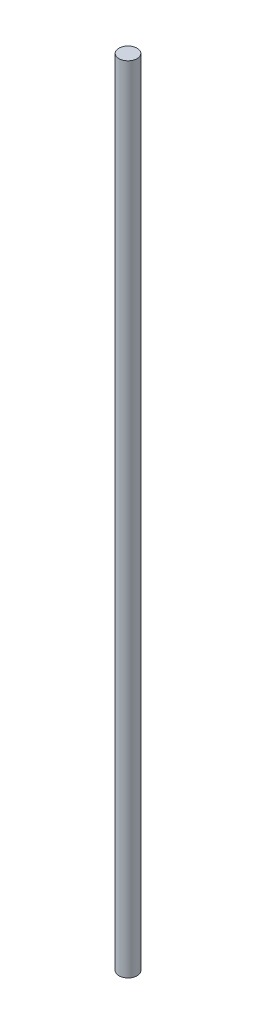
ISO-10303-21;
HEADER;
FILE_DESCRIPTION(('STEP AP214'),'2;1');
FILE_NAME('part.step','',(''),(''),'','','');
FILE_SCHEMA(('AUTOMOTIVE_DESIGN { 1 0 10303 214 1 1 1 1 }'));
ENDSEC;
DATA;
#1=APPLICATION_CONTEXT('core data for automotive mechanical design processes');
#2=APPLICATION_PROTOCOL_DEFINITION('international standard','automotive_design',2000,#1);
#3=PRODUCT_CONTEXT('',#1,'mechanical');
#4=PRODUCT('Part','Part','',(#3));
#5=PRODUCT_RELATED_PRODUCT_CATEGORY('part','',(#4));
#6=PRODUCT_DEFINITION_FORMATION('','',#4);
#7=PRODUCT_DEFINITION_CONTEXT('part definition',#1,'design');
#8=PRODUCT_DEFINITION('design','',#6,#7);
#9=PRODUCT_DEFINITION_SHAPE('','',#8);
#10=(LENGTH_UNIT() NAMED_UNIT(*) SI_UNIT(.MILLI.,.METRE.));
#11=(NAMED_UNIT(*) PLANE_ANGLE_UNIT() SI_UNIT($,.RADIAN.));
#12=(NAMED_UNIT(*) SI_UNIT($,.STERADIAN.) SOLID_ANGLE_UNIT());
#13=UNCERTAINTY_MEASURE_WITH_UNIT(LENGTH_MEASURE(1.E-05),#10,'distance_accuracy_value','');
#14=(GEOMETRIC_REPRESENTATION_CONTEXT(3) GLOBAL_UNCERTAINTY_ASSIGNED_CONTEXT((#13)) GLOBAL_UNIT_ASSIGNED_CONTEXT((#10,
#11,#12)) REPRESENTATION_CONTEXT('',''));
#15=CARTESIAN_POINT('',(0.,0.,0.));
#16=DIRECTION('',(0.,0.,1.));
#17=DIRECTION('',(1.,0.,0.));
#18=AXIS2_PLACEMENT_3D('',#15,#16,#17);
#19=CARTESIAN_POINT('',(0.,350.,0.));
#20=DIRECTION('',(0.,-1.,0.));
#21=DIRECTION('',(0.,0.,-1.));
#22=AXIS2_PLACEMENT_3D('',#19,#20,#21);
#23=CYLINDRICAL_SURFACE('',#22,4.);
#24=CARTESIAN_POINT('',(0.,350.,0.));
#25=DIRECTION('',(0.,-1.,0.));
#26=DIRECTION('',(0.,0.,-1.));
#27=AXIS2_PLACEMENT_3D('',#24,#25,#26);
#28=CIRCLE('',#27,4.);
#29=CARTESIAN_POINT('',(0.,350.,-4.));
#30=VERTEX_POINT('',#29);
#31=EDGE_CURVE('E10',#30,#30,#28,.T.);
#32=ORIENTED_EDGE('',*,*,#31,.T.);
#33=EDGE_LOOP('',(#32));
#34=FACE_BOUND('',#33,.T.);
#35=CARTESIAN_POINT('',(0.,0.,0.));
#36=DIRECTION('',(0.,-1.,0.));
#37=DIRECTION('',(0.,0.,-1.));
#38=AXIS2_PLACEMENT_3D('',#35,#36,#37);
#39=CIRCLE('',#38,4.);
#40=CARTESIAN_POINT('',(0.,0.,-4.));
#41=VERTEX_POINT('',#40);
#42=EDGE_CURVE('E41',#41,#41,#39,.T.);
#43=ORIENTED_EDGE('',*,*,#42,.F.);
#44=EDGE_LOOP('',(#43));
#45=FACE_BOUND('',#44,.T.);
#46=ADVANCED_FACE('F35',(#34,#45),#23,.T.);
#47=CARTESIAN_POINT('',(4.,350.,0.));
#48=DIRECTION('',(0.,1.,0.));
#49=DIRECTION('',(0.,0.,1.));
#50=AXIS2_PLACEMENT_3D('',#47,#48,#49);
#51=PLANE('',#50);
#52=ORIENTED_EDGE('',*,*,#31,.F.);
#53=EDGE_LOOP('',(#52));
#54=FACE_BOUND('',#53,.T.);
#55=ADVANCED_FACE('F50',(#54),#51,.T.);
#56=CARTESIAN_POINT('',(0.,0.,0.));
#57=DIRECTION('',(0.,-1.,0.));
#58=DIRECTION('',(0.,0.,-1.));
#59=AXIS2_PLACEMENT_3D('',#56,#57,#58);
#60=PLANE('',#59);
#61=ORIENTED_EDGE('',*,*,#42,.T.);
#62=EDGE_LOOP('',(#61));
#63=FACE_BOUND('',#62,.T.);
#64=ADVANCED_FACE('F47',(#63),#60,.T.);
#65=CLOSED_SHELL('',(#46,#55,#64));
#66=MANIFOLD_SOLID_BREP('B2',#65);
#67=ADVANCED_BREP_SHAPE_REPRESENTATION('',(#18,#66),#14);
#68=SHAPE_DEFINITION_REPRESENTATION(#9,#67);
ENDSEC;
END-ISO-10303-21;
